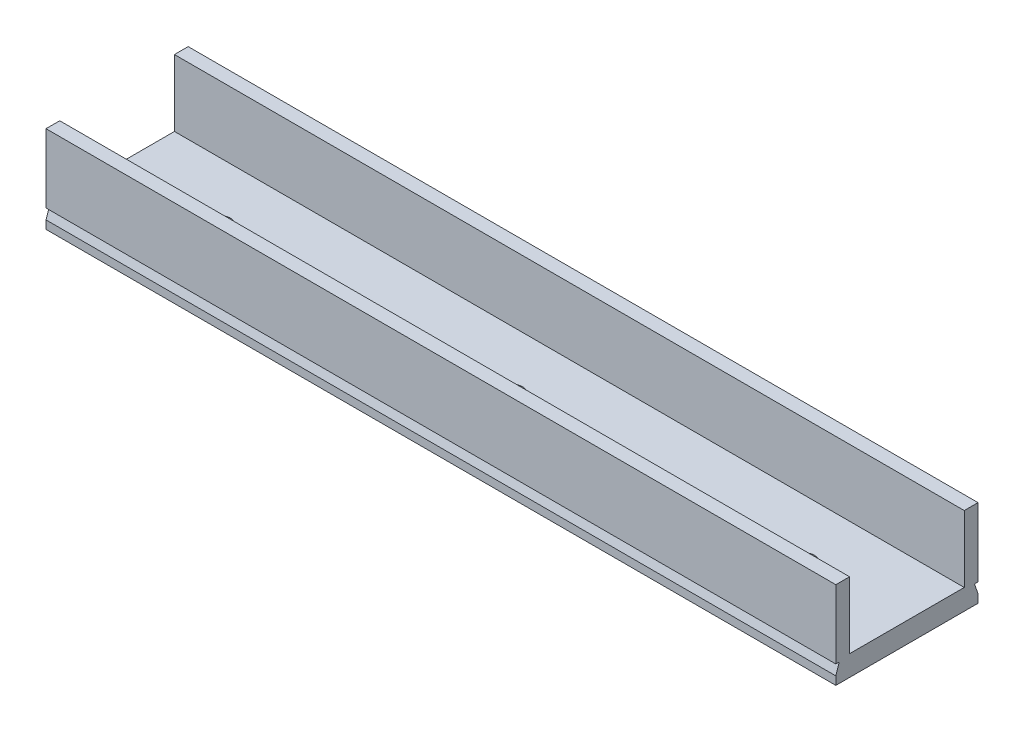
ISO-10303-21;
HEADER;
FILE_DESCRIPTION(('STEP AP214'),'2;1');
FILE_NAME('part.step','',(''),(''),'','','');
FILE_SCHEMA(('AUTOMOTIVE_DESIGN { 1 0 10303 214 1 1 1 1 }'));
ENDSEC;
DATA;
#1=APPLICATION_CONTEXT('core data for automotive mechanical design processes');
#2=APPLICATION_PROTOCOL_DEFINITION('international standard','automotive_design',2000,#1);
#3=PRODUCT_CONTEXT('',#1,'mechanical');
#4=PRODUCT('Part','Part','',(#3));
#5=PRODUCT_RELATED_PRODUCT_CATEGORY('part','',(#4));
#6=PRODUCT_DEFINITION_FORMATION('','',#4);
#7=PRODUCT_DEFINITION_CONTEXT('part definition',#1,'design');
#8=PRODUCT_DEFINITION('design','',#6,#7);
#9=PRODUCT_DEFINITION_SHAPE('','',#8);
#10=(LENGTH_UNIT() NAMED_UNIT(*) SI_UNIT(.MILLI.,.METRE.));
#11=(NAMED_UNIT(*) PLANE_ANGLE_UNIT() SI_UNIT($,.RADIAN.));
#12=(NAMED_UNIT(*) SI_UNIT($,.STERADIAN.) SOLID_ANGLE_UNIT());
#13=UNCERTAINTY_MEASURE_WITH_UNIT(LENGTH_MEASURE(1.E-05),#10,'distance_accuracy_value','');
#14=(GEOMETRIC_REPRESENTATION_CONTEXT(3) GLOBAL_UNCERTAINTY_ASSIGNED_CONTEXT((#13)) GLOBAL_UNIT_ASSIGNED_CONTEXT((#10,
#11,#12)) REPRESENTATION_CONTEXT('',''));
#15=CARTESIAN_POINT('',(0.,0.,0.));
#16=DIRECTION('',(0.,0.,1.));
#17=DIRECTION('',(1.,0.,0.));
#18=AXIS2_PLACEMENT_3D('',#15,#16,#17);
#19=CARTESIAN_POINT('',(0.,3.,-10.35));
#20=DIRECTION('',(0.,0.,1.));
#21=DIRECTION('',(1.,0.,0.));
#22=AXIS2_PLACEMENT_3D('',#19,#20,#21);
#23=PLANE('',#22);
#24=DIRECTION('',(0.,-1.,0.));
#25=VECTOR('',#24,1.);
#26=CARTESIAN_POINT('',(57.5,3.,-10.35));
#27=LINE('',#26,#25);
#28=CARTESIAN_POINT('',(57.5,12.7,-10.35));
#29=VERTEX_POINT('',#28);
#30=CARTESIAN_POINT('',(57.5,2.7,-10.35));
#31=VERTEX_POINT('',#30);
#32=EDGE_CURVE('E256',#29,#31,#27,.T.);
#33=ORIENTED_EDGE('',*,*,#32,.T.);
#34=DIRECTION('',(-1.,0.,0.));
#35=VECTOR('',#34,1.);
#36=CARTESIAN_POINT('',(166.5,2.7,-10.35));
#37=LINE('',#36,#35);
#38=CARTESIAN_POINT('',(-57.5,2.7,-10.35));
#39=VERTEX_POINT('',#38);
#40=EDGE_CURVE('E144',#31,#39,#37,.T.);
#41=ORIENTED_EDGE('',*,*,#40,.T.);
#42=DIRECTION('',(0.,-1.,0.));
#43=VECTOR('',#42,1.);
#44=CARTESIAN_POINT('',(-57.5,3.,-10.35));
#45=LINE('',#44,#43);
#46=CARTESIAN_POINT('',(-57.5,12.7,-10.35));
#47=VERTEX_POINT('',#46);
#48=EDGE_CURVE('E155',#47,#39,#45,.T.);
#49=ORIENTED_EDGE('',*,*,#48,.F.);
#50=DIRECTION('',(-1.,0.,0.));
#51=VECTOR('',#50,1.);
#52=CARTESIAN_POINT('',(-57.5,12.7,-10.35));
#53=LINE('',#52,#51);
#54=EDGE_CURVE('E198',#29,#47,#53,.T.);
#55=ORIENTED_EDGE('',*,*,#54,.F.);
#56=EDGE_LOOP('',(#33,#41,#49,#55));
#57=FACE_BOUND('',#56,.T.);
#58=ADVANCED_FACE('F35',(#57),#23,.F.);
#59=CARTESIAN_POINT('',(0.,3.,10.35));
#60=DIRECTION('',(0.,0.,1.));
#61=DIRECTION('',(1.,0.,0.));
#62=AXIS2_PLACEMENT_3D('',#59,#60,#61);
#63=PLANE('',#62);
#64=DIRECTION('',(1.,0.,0.));
#65=VECTOR('',#64,1.);
#66=CARTESIAN_POINT('',(0.,1.20000000000002,10.35));
#67=LINE('',#66,#65);
#68=CARTESIAN_POINT('',(-57.5,1.2,10.35));
#69=VERTEX_POINT('',#68);
#70=CARTESIAN_POINT('',(57.5,1.2,10.35));
#71=VERTEX_POINT('',#70);
#72=EDGE_CURVE('E11',#69,#71,#67,.T.);
#73=ORIENTED_EDGE('',*,*,#72,.F.);
#74=DIRECTION('',(0.,-1.,0.));
#75=VECTOR('',#74,1.);
#76=CARTESIAN_POINT('',(-57.5,3.,10.35));
#77=LINE('',#76,#75);
#78=CARTESIAN_POINT('',(-57.5,0.,10.35));
#79=VERTEX_POINT('',#78);
#80=EDGE_CURVE('E249',#69,#79,#77,.T.);
#81=ORIENTED_EDGE('',*,*,#80,.T.);
#82=DIRECTION('',(-1.,0.,0.));
#83=VECTOR('',#82,1.);
#84=CARTESIAN_POINT('',(0.,0.,10.35));
#85=LINE('',#84,#83);
#86=CARTESIAN_POINT('',(57.5,0.,10.35));
#87=VERTEX_POINT('',#86);
#88=EDGE_CURVE('E233',#87,#79,#85,.T.);
#89=ORIENTED_EDGE('',*,*,#88,.F.);
#90=DIRECTION('',(0.,-1.,0.));
#91=VECTOR('',#90,1.);
#92=CARTESIAN_POINT('',(57.5,3.,10.35));
#93=LINE('',#92,#91);
#94=EDGE_CURVE('E235',#71,#87,#93,.T.);
#95=ORIENTED_EDGE('',*,*,#94,.F.);
#96=EDGE_LOOP('',(#73,#81,#89,#95));
#97=FACE_BOUND('',#96,.T.);
#98=ADVANCED_FACE('F301',(#97),#63,.T.);
#99=CARTESIAN_POINT('',(0.,3.,0.));
#100=DIRECTION('',(0.,1.,0.));
#101=DIRECTION('',(0.,0.,1.));
#102=AXIS2_PLACEMENT_3D('',#99,#100,#101);
#103=PLANE('',#102);
#104=CARTESIAN_POINT('',(-42.5,3.,0.));
#105=DIRECTION('',(0.,1.,0.));
#106=DIRECTION('',(0.,0.,1.));
#107=AXIS2_PLACEMENT_3D('',#104,#105,#106);
#108=CIRCLE('',#107,1.5);
#109=CARTESIAN_POINT('',(-42.5,3.,1.5));
#110=VERTEX_POINT('',#109);
#111=EDGE_CURVE('E216',#110,#110,#108,.T.);
#112=ORIENTED_EDGE('',*,*,#111,.F.);
#113=EDGE_LOOP('',(#112));
#114=FACE_BOUND('',#113,.T.);
#115=CARTESIAN_POINT('',(0.,3.,0.));
#116=DIRECTION('',(0.,1.,0.));
#117=DIRECTION('',(0.,0.,1.));
#118=AXIS2_PLACEMENT_3D('',#115,#116,#117);
#119=CIRCLE('',#118,1.5);
#120=CARTESIAN_POINT('',(0.,3.,1.5));
#121=VERTEX_POINT('',#120);
#122=EDGE_CURVE('E222',#121,#121,#119,.T.);
#123=ORIENTED_EDGE('',*,*,#122,.F.);
#124=EDGE_LOOP('',(#123));
#125=FACE_BOUND('',#124,.T.);
#126=CARTESIAN_POINT('',(42.5,3.,0.));
#127=DIRECTION('',(0.,1.,0.));
#128=DIRECTION('',(0.,0.,-1.));
#129=AXIS2_PLACEMENT_3D('',#126,#127,#128);
#130=CIRCLE('',#129,1.5);
#131=CARTESIAN_POINT('',(42.5,3.,-1.5));
#132=VERTEX_POINT('',#131);
#133=EDGE_CURVE('E211',#132,#132,#130,.T.);
#134=ORIENTED_EDGE('',*,*,#133,.F.);
#135=EDGE_LOOP('',(#134));
#136=FACE_BOUND('',#135,.T.);
#137=DIRECTION('',(0.,0.,-1.));
#138=VECTOR('',#137,1.);
#139=CARTESIAN_POINT('',(-57.5,3.,0.));
#140=LINE('',#139,#138);
#141=CARTESIAN_POINT('',(-57.5,3.,8.35000000000002));
#142=VERTEX_POINT('',#141);
#143=CARTESIAN_POINT('',(-57.5,3.,-8.35000000000001));
#144=VERTEX_POINT('',#143);
#145=EDGE_CURVE('E232',#142,#144,#140,.T.);
#146=ORIENTED_EDGE('',*,*,#145,.F.);
#147=DIRECTION('',(-1.,0.,0.));
#148=VECTOR('',#147,1.);
#149=CARTESIAN_POINT('',(57.5,3.,8.35));
#150=LINE('',#149,#148);
#151=CARTESIAN_POINT('',(57.5,3.,8.35));
#152=VERTEX_POINT('',#151);
#153=EDGE_CURVE('E173',#152,#142,#150,.T.);
#154=ORIENTED_EDGE('',*,*,#153,.F.);
#155=DIRECTION('',(0.,0.,-1.));
#156=VECTOR('',#155,1.);
#157=CARTESIAN_POINT('',(57.5,3.,0.));
#158=LINE('',#157,#156);
#159=CARTESIAN_POINT('',(57.5,3.,-8.35000000000002));
#160=VERTEX_POINT('',#159);
#161=EDGE_CURVE('E230',#152,#160,#158,.T.);
#162=ORIENTED_EDGE('',*,*,#161,.T.);
#163=DIRECTION('',(1.,0.,0.));
#164=VECTOR('',#163,1.);
#165=CARTESIAN_POINT('',(57.5,3.,-8.35000000000002));
#166=LINE('',#165,#164);
#167=EDGE_CURVE('E191',#144,#160,#166,.T.);
#168=ORIENTED_EDGE('',*,*,#167,.F.);
#169=EDGE_LOOP('',(#146,#154,#162,#168));
#170=FACE_BOUND('',#169,.T.);
#171=ADVANCED_FACE('F278',(#114,#125,#136,#170),#103,.T.);
#172=CARTESIAN_POINT('',(57.5,3.,0.));
#173=DIRECTION('',(-1.,0.,0.));
#174=DIRECTION('',(0.,0.,1.));
#175=AXIS2_PLACEMENT_3D('',#172,#173,#174);
#176=PLANE('',#175);
#177=DIRECTION('',(0.,0.948683298050513,0.316227766016839));
#178=VECTOR('',#177,1.);
#179=CARTESIAN_POINT('',(57.5,5.92500000000001,-8.77499999999999));
#180=LINE('',#179,#178);
#181=CARTESIAN_POINT('',(57.5,1.2,-10.35));
#182=VERTEX_POINT('',#181);
#183=CARTESIAN_POINT('',(57.5,2.7,-9.85));
#184=VERTEX_POINT('',#183);
#185=EDGE_CURVE('E170',#182,#184,#180,.T.);
#186=ORIENTED_EDGE('',*,*,#185,.T.);
#187=DIRECTION('',(0.,0.,-1.));
#188=VECTOR('',#187,1.);
#189=CARTESIAN_POINT('',(57.5,2.7,0.));
#190=LINE('',#189,#188);
#191=EDGE_CURVE('E142',#184,#31,#190,.T.);
#192=ORIENTED_EDGE('',*,*,#191,.T.);
#193=ORIENTED_EDGE('',*,*,#32,.F.);
#194=DIRECTION('',(0.,0.,-1.));
#195=VECTOR('',#194,1.);
#196=CARTESIAN_POINT('',(57.5,12.7,-10.35));
#197=LINE('',#196,#195);
#198=CARTESIAN_POINT('',(57.5,12.7,-8.35000000000002));
#199=VERTEX_POINT('',#198);
#200=EDGE_CURVE('E195',#199,#29,#197,.T.);
#201=ORIENTED_EDGE('',*,*,#200,.F.);
#202=DIRECTION('',(0.,-1.,0.));
#203=VECTOR('',#202,1.);
#204=CARTESIAN_POINT('',(57.5,12.7,-8.35000000000002));
#205=LINE('',#204,#203);
#206=EDGE_CURVE('E208',#199,#160,#205,.T.);
#207=ORIENTED_EDGE('',*,*,#206,.T.);
#208=ORIENTED_EDGE('',*,*,#161,.F.);
#209=DIRECTION('',(0.,-1.,0.));
#210=VECTOR('',#209,1.);
#211=CARTESIAN_POINT('',(57.5,12.7,8.35));
#212=LINE('',#211,#210);
#213=CARTESIAN_POINT('',(57.5,12.7,8.35));
#214=VERTEX_POINT('',#213);
#215=EDGE_CURVE('E189',#214,#152,#212,.T.);
#216=ORIENTED_EDGE('',*,*,#215,.F.);
#217=DIRECTION('',(0.,0.,-1.));
#218=VECTOR('',#217,1.);
#219=CARTESIAN_POINT('',(57.5,12.7,10.35));
#220=LINE('',#219,#218);
#221=CARTESIAN_POINT('',(57.5,12.7,10.35));
#222=VERTEX_POINT('',#221);
#223=EDGE_CURVE('E174',#222,#214,#220,.T.);
#224=ORIENTED_EDGE('',*,*,#223,.F.);
#225=CARTESIAN_POINT('',(57.5,2.7,10.35));
#226=VERTEX_POINT('',#225);
#227=EDGE_CURVE('E246',#222,#226,#93,.T.);
#228=ORIENTED_EDGE('',*,*,#227,.T.);
#229=DIRECTION('',(0.,0.,-1.));
#230=VECTOR('',#229,1.);
#231=CARTESIAN_POINT('',(57.5,2.7,0.));
#232=LINE('',#231,#230);
#233=CARTESIAN_POINT('',(57.5,2.7,9.85));
#234=VERTEX_POINT('',#233);
#235=EDGE_CURVE('E58',#226,#234,#232,.T.);
#236=ORIENTED_EDGE('',*,*,#235,.T.);
#237=DIRECTION('',(0.,-0.948683298050513,0.316227766016839));
#238=VECTOR('',#237,1.);
#239=CARTESIAN_POINT('',(57.5,5.92500000000001,8.77499999999999));
#240=LINE('',#239,#238);
#241=EDGE_CURVE('E167',#234,#71,#240,.T.);
#242=ORIENTED_EDGE('',*,*,#241,.T.);
#243=ORIENTED_EDGE('',*,*,#94,.T.);
#244=DIRECTION('',(0.,0.,-1.));
#245=VECTOR('',#244,1.);
#246=CARTESIAN_POINT('',(57.5,0.,0.));
#247=LINE('',#246,#245);
#248=CARTESIAN_POINT('',(57.5,0.,-10.35));
#249=VERTEX_POINT('',#248);
#250=EDGE_CURVE('E215',#87,#249,#247,.T.);
#251=ORIENTED_EDGE('',*,*,#250,.T.);
#252=EDGE_CURVE('E255',#182,#249,#27,.T.);
#253=ORIENTED_EDGE('',*,*,#252,.F.);
#254=EDGE_LOOP('',(#186,#192,#193,#201,#207,#208,#216,#224,#228,#236,#242,#243,#251,#253));
#255=FACE_BOUND('',#254,.T.);
#256=ADVANCED_FACE('F37',(#255),#176,.F.);
#257=CARTESIAN_POINT('',(-57.5,1.2,-10.35));
#258=VERTEX_POINT('',#257);
#259=CARTESIAN_POINT('',(-57.5,0.,-10.35));
#260=VERTEX_POINT('',#259);
#261=EDGE_CURVE('E253',#258,#260,#45,.T.);
#262=ORIENTED_EDGE('',*,*,#261,.F.);
#263=DIRECTION('',(-1.,0.,0.));
#264=VECTOR('',#263,1.);
#265=CARTESIAN_POINT('',(166.5,1.2,-10.35));
#266=LINE('',#265,#264);
#267=EDGE_CURVE('E50',#182,#258,#266,.T.);
#268=ORIENTED_EDGE('',*,*,#267,.F.);
#269=ORIENTED_EDGE('',*,*,#252,.T.);
#270=DIRECTION('',(-1.,0.,0.));
#271=VECTOR('',#270,1.);
#272=CARTESIAN_POINT('',(0.,0.,-10.35));
#273=LINE('',#272,#271);
#274=EDGE_CURVE('E238',#249,#260,#273,.T.);
#275=ORIENTED_EDGE('',*,*,#274,.T.);
#276=EDGE_LOOP('',(#262,#268,#269,#275));
#277=FACE_BOUND('',#276,.T.);
#278=ADVANCED_FACE('F291',(#277),#23,.F.);
#279=CARTESIAN_POINT('',(-57.5,3.,0.));
#280=DIRECTION('',(-1.,0.,0.));
#281=DIRECTION('',(0.,0.,1.));
#282=AXIS2_PLACEMENT_3D('',#279,#280,#281);
#283=PLANE('',#282);
#284=DIRECTION('',(0.,0.,-1.));
#285=VECTOR('',#284,1.);
#286=CARTESIAN_POINT('',(-57.5,2.7,-10.35));
#287=LINE('',#286,#285);
#288=CARTESIAN_POINT('',(-57.5,2.7,-9.85));
#289=VERTEX_POINT('',#288);
#290=EDGE_CURVE('E139',#289,#39,#287,.T.);
#291=ORIENTED_EDGE('',*,*,#290,.F.);
#292=DIRECTION('',(0.,0.948683298050513,0.316227766016839));
#293=VECTOR('',#292,1.);
#294=CARTESIAN_POINT('',(-57.5,2.7,-9.85));
#295=LINE('',#294,#293);
#296=EDGE_CURVE('E146',#258,#289,#295,.T.);
#297=ORIENTED_EDGE('',*,*,#296,.F.);
#298=ORIENTED_EDGE('',*,*,#261,.T.);
#299=DIRECTION('',(0.,0.,-1.));
#300=VECTOR('',#299,1.);
#301=CARTESIAN_POINT('',(-57.5,0.,0.));
#302=LINE('',#301,#300);
#303=EDGE_CURVE('E241',#79,#260,#302,.T.);
#304=ORIENTED_EDGE('',*,*,#303,.F.);
#305=ORIENTED_EDGE('',*,*,#80,.F.);
#306=DIRECTION('',(0.,-0.948683298050513,0.316227766016839));
#307=VECTOR('',#306,1.);
#308=CARTESIAN_POINT('',(-57.5,2.7,9.85));
#309=LINE('',#308,#307);
#310=CARTESIAN_POINT('',(-57.5,2.7,9.85));
#311=VERTEX_POINT('',#310);
#312=EDGE_CURVE('E163',#311,#69,#309,.T.);
#313=ORIENTED_EDGE('',*,*,#312,.F.);
#314=DIRECTION('',(0.,0.,-1.));
#315=VECTOR('',#314,1.);
#316=CARTESIAN_POINT('',(-57.5,2.7,10.35));
#317=LINE('',#316,#315);
#318=CARTESIAN_POINT('',(-57.5,2.7,10.35));
#319=VERTEX_POINT('',#318);
#320=EDGE_CURVE('E160',#319,#311,#317,.T.);
#321=ORIENTED_EDGE('',*,*,#320,.F.);
#322=CARTESIAN_POINT('',(-57.5,12.7,10.35));
#323=VERTEX_POINT('',#322);
#324=EDGE_CURVE('E250',#323,#319,#77,.T.);
#325=ORIENTED_EDGE('',*,*,#324,.F.);
#326=DIRECTION('',(0.,0.,1.));
#327=VECTOR('',#326,1.);
#328=CARTESIAN_POINT('',(-57.5,12.7,8.35000000000002));
#329=LINE('',#328,#327);
#330=CARTESIAN_POINT('',(-57.5,12.7,8.35000000000002));
#331=VERTEX_POINT('',#330);
#332=EDGE_CURVE('E179',#331,#323,#329,.T.);
#333=ORIENTED_EDGE('',*,*,#332,.F.);
#334=DIRECTION('',(0.,-1.,0.));
#335=VECTOR('',#334,1.);
#336=CARTESIAN_POINT('',(-57.5,12.7,8.35000000000002));
#337=LINE('',#336,#335);
#338=EDGE_CURVE('E185',#331,#142,#337,.T.);
#339=ORIENTED_EDGE('',*,*,#338,.T.);
#340=ORIENTED_EDGE('',*,*,#145,.T.);
#341=DIRECTION('',(0.,-1.,0.));
#342=VECTOR('',#341,1.);
#343=CARTESIAN_POINT('',(-57.5,12.7,-8.35));
#344=LINE('',#343,#342);
#345=CARTESIAN_POINT('',(-57.5,12.7,-8.35));
#346=VERTEX_POINT('',#345);
#347=EDGE_CURVE('E203',#346,#144,#344,.T.);
#348=ORIENTED_EDGE('',*,*,#347,.F.);
#349=DIRECTION('',(0.,0.,1.));
#350=VECTOR('',#349,1.);
#351=CARTESIAN_POINT('',(-57.5,12.7,-8.35));
#352=LINE('',#351,#350);
#353=EDGE_CURVE('E201',#47,#346,#352,.T.);
#354=ORIENTED_EDGE('',*,*,#353,.F.);
#355=ORIENTED_EDGE('',*,*,#48,.T.);
#356=EDGE_LOOP('',(#291,#297,#298,#304,#305,#313,#321,#325,#333,#339,#340,#348,#354,#355));
#357=FACE_BOUND('',#356,.T.);
#358=ADVANCED_FACE('F153',(#357),#283,.T.);
#359=DIRECTION('',(-1.,0.,0.));
#360=VECTOR('',#359,1.);
#361=CARTESIAN_POINT('',(0.,2.7,10.35));
#362=LINE('',#361,#360);
#363=EDGE_CURVE('E43',#226,#319,#362,.T.);
#364=ORIENTED_EDGE('',*,*,#363,.F.);
#365=ORIENTED_EDGE('',*,*,#227,.F.);
#366=DIRECTION('',(1.,0.,0.));
#367=VECTOR('',#366,1.);
#368=CARTESIAN_POINT('',(-57.5,12.7,10.35));
#369=LINE('',#368,#367);
#370=EDGE_CURVE('E182',#323,#222,#369,.T.);
#371=ORIENTED_EDGE('',*,*,#370,.F.);
#372=ORIENTED_EDGE('',*,*,#324,.T.);
#373=EDGE_LOOP('',(#364,#365,#371,#372));
#374=FACE_BOUND('',#373,.T.);
#375=ADVANCED_FACE('F265',(#374),#63,.T.);
#376=CARTESIAN_POINT('',(0.,0.,0.));
#377=DIRECTION('',(0.,1.,0.));
#378=DIRECTION('',(0.,0.,1.));
#379=AXIS2_PLACEMENT_3D('',#376,#377,#378);
#380=PLANE('',#379);
#381=CARTESIAN_POINT('',(-42.5,0.,0.));
#382=DIRECTION('',(0.,1.,0.));
#383=DIRECTION('',(0.,0.,1.));
#384=AXIS2_PLACEMENT_3D('',#381,#382,#383);
#385=CIRCLE('',#384,1.5);
#386=CARTESIAN_POINT('',(-42.5,0.,1.5));
#387=VERTEX_POINT('',#386);
#388=EDGE_CURVE('E212',#387,#387,#385,.T.);
#389=ORIENTED_EDGE('',*,*,#388,.T.);
#390=EDGE_LOOP('',(#389));
#391=FACE_BOUND('',#390,.T.);
#392=CARTESIAN_POINT('',(0.,0.,0.));
#393=DIRECTION('',(0.,1.,0.));
#394=DIRECTION('',(0.,0.,1.));
#395=AXIS2_PLACEMENT_3D('',#392,#393,#394);
#396=CIRCLE('',#395,1.5);
#397=CARTESIAN_POINT('',(0.,0.,1.5));
#398=VERTEX_POINT('',#397);
#399=EDGE_CURVE('E219',#398,#398,#396,.T.);
#400=ORIENTED_EDGE('',*,*,#399,.T.);
#401=EDGE_LOOP('',(#400));
#402=FACE_BOUND('',#401,.T.);
#403=CARTESIAN_POINT('',(42.5,0.,0.));
#404=DIRECTION('',(0.,1.,0.));
#405=DIRECTION('',(0.,0.,-1.));
#406=AXIS2_PLACEMENT_3D('',#403,#404,#405);
#407=CIRCLE('',#406,1.5);
#408=CARTESIAN_POINT('',(42.5,0.,-1.5));
#409=VERTEX_POINT('',#408);
#410=EDGE_CURVE('E225',#409,#409,#407,.T.);
#411=ORIENTED_EDGE('',*,*,#410,.T.);
#412=EDGE_LOOP('',(#411));
#413=FACE_BOUND('',#412,.T.);
#414=ORIENTED_EDGE('',*,*,#250,.F.);
#415=ORIENTED_EDGE('',*,*,#88,.T.);
#416=ORIENTED_EDGE('',*,*,#303,.T.);
#417=ORIENTED_EDGE('',*,*,#274,.F.);
#418=EDGE_LOOP('',(#414,#415,#416,#417));
#419=FACE_BOUND('',#418,.T.);
#420=ADVANCED_FACE('F297',(#391,#402,#413,#419),#380,.F.);
#421=CARTESIAN_POINT('',(42.5,0.,0.));
#422=DIRECTION('',(0.,1.,0.));
#423=DIRECTION('',(0.,0.,1.));
#424=AXIS2_PLACEMENT_3D('',#421,#422,#423);
#425=CYLINDRICAL_SURFACE('',#424,1.5);
#426=ORIENTED_EDGE('',*,*,#410,.F.);
#427=EDGE_LOOP('',(#426));
#428=FACE_BOUND('',#427,.T.);
#429=ORIENTED_EDGE('',*,*,#133,.T.);
#430=EDGE_LOOP('',(#429));
#431=FACE_BOUND('',#430,.T.);
#432=ADVANCED_FACE('F335',(#428,#431),#425,.F.);
#433=CARTESIAN_POINT('',(0.,0.,0.));
#434=DIRECTION('',(0.,1.,0.));
#435=DIRECTION('',(0.,0.,1.));
#436=AXIS2_PLACEMENT_3D('',#433,#434,#435);
#437=CYLINDRICAL_SURFACE('',#436,1.5);
#438=ORIENTED_EDGE('',*,*,#399,.F.);
#439=EDGE_LOOP('',(#438));
#440=FACE_BOUND('',#439,.T.);
#441=ORIENTED_EDGE('',*,*,#122,.T.);
#442=EDGE_LOOP('',(#441));
#443=FACE_BOUND('',#442,.T.);
#444=ADVANCED_FACE('F354',(#440,#443),#437,.F.);
#445=CARTESIAN_POINT('',(-42.5,0.,0.));
#446=DIRECTION('',(0.,1.,0.));
#447=DIRECTION('',(0.,0.,1.));
#448=AXIS2_PLACEMENT_3D('',#445,#446,#447);
#449=CYLINDRICAL_SURFACE('',#448,1.5);
#450=ORIENTED_EDGE('',*,*,#388,.F.);
#451=EDGE_LOOP('',(#450));
#452=FACE_BOUND('',#451,.T.);
#453=ORIENTED_EDGE('',*,*,#111,.T.);
#454=EDGE_LOOP('',(#453));
#455=FACE_BOUND('',#454,.T.);
#456=ADVANCED_FACE('F361',(#452,#455),#449,.F.);
#457=CARTESIAN_POINT('',(57.5,12.7,-8.35000000000002));
#458=DIRECTION('',(0.,0.,-1.));
#459=DIRECTION('',(-1.,0.,0.));
#460=AXIS2_PLACEMENT_3D('',#457,#458,#459);
#461=PLANE('',#460);
#462=ORIENTED_EDGE('',*,*,#167,.T.);
#463=ORIENTED_EDGE('',*,*,#206,.F.);
#464=DIRECTION('',(1.,0.,0.));
#465=VECTOR('',#464,1.);
#466=CARTESIAN_POINT('',(57.5,12.7,-8.35000000000002));
#467=LINE('',#466,#465);
#468=EDGE_CURVE('E192',#346,#199,#467,.T.);
#469=ORIENTED_EDGE('',*,*,#468,.F.);
#470=ORIENTED_EDGE('',*,*,#347,.T.);
#471=EDGE_LOOP('',(#462,#463,#469,#470));
#472=FACE_BOUND('',#471,.T.);
#473=ADVANCED_FACE('F284',(#472),#461,.F.);
#474=CARTESIAN_POINT('',(0.,12.7,0.));
#475=DIRECTION('',(0.,-1.,0.));
#476=DIRECTION('',(0.,0.,-1.));
#477=AXIS2_PLACEMENT_3D('',#474,#475,#476);
#478=PLANE('',#477);
#479=ORIENTED_EDGE('',*,*,#468,.T.);
#480=ORIENTED_EDGE('',*,*,#200,.T.);
#481=ORIENTED_EDGE('',*,*,#54,.T.);
#482=ORIENTED_EDGE('',*,*,#353,.T.);
#483=EDGE_LOOP('',(#479,#480,#481,#482));
#484=FACE_BOUND('',#483,.T.);
#485=ADVANCED_FACE('F286',(#484),#478,.F.);
#486=CARTESIAN_POINT('',(57.5,12.7,8.35));
#487=DIRECTION('',(0.,0.,1.));
#488=DIRECTION('',(1.,0.,0.));
#489=AXIS2_PLACEMENT_3D('',#486,#487,#488);
#490=PLANE('',#489);
#491=ORIENTED_EDGE('',*,*,#153,.T.);
#492=ORIENTED_EDGE('',*,*,#338,.F.);
#493=DIRECTION('',(-1.,0.,0.));
#494=VECTOR('',#493,1.);
#495=CARTESIAN_POINT('',(57.5,12.7,8.35));
#496=LINE('',#495,#494);
#497=EDGE_CURVE('E177',#214,#331,#496,.T.);
#498=ORIENTED_EDGE('',*,*,#497,.F.);
#499=ORIENTED_EDGE('',*,*,#215,.T.);
#500=EDGE_LOOP('',(#491,#492,#498,#499));
#501=FACE_BOUND('',#500,.T.);
#502=ADVANCED_FACE('F274',(#501),#490,.F.);
#503=CARTESIAN_POINT('',(0.,12.7,0.));
#504=DIRECTION('',(0.,1.,0.));
#505=DIRECTION('',(0.,0.,1.));
#506=AXIS2_PLACEMENT_3D('',#503,#504,#505);
#507=PLANE('',#506);
#508=ORIENTED_EDGE('',*,*,#223,.T.);
#509=ORIENTED_EDGE('',*,*,#497,.T.);
#510=ORIENTED_EDGE('',*,*,#332,.T.);
#511=ORIENTED_EDGE('',*,*,#370,.T.);
#512=EDGE_LOOP('',(#508,#509,#510,#511));
#513=FACE_BOUND('',#512,.T.);
#514=ADVANCED_FACE('F268',(#513),#507,.T.);
#515=CARTESIAN_POINT('',(166.5,2.7,9.85));
#516=DIRECTION('',(0.,-0.316227766016839,-0.948683298050513));
#517=DIRECTION('',(0.,0.948683298050513,-0.316227766016839));
#518=AXIS2_PLACEMENT_3D('',#515,#516,#517);
#519=PLANE('',#518);
#520=DIRECTION('',(-1.,0.,0.));
#521=VECTOR('',#520,1.);
#522=CARTESIAN_POINT('',(166.5,2.7,9.85));
#523=LINE('',#522,#521);
#524=EDGE_CURVE('E150',#234,#311,#523,.T.);
#525=ORIENTED_EDGE('',*,*,#524,.T.);
#526=ORIENTED_EDGE('',*,*,#312,.T.);
#527=ORIENTED_EDGE('',*,*,#72,.T.);
#528=ORIENTED_EDGE('',*,*,#241,.F.);
#529=EDGE_LOOP('',(#525,#526,#527,#528));
#530=FACE_BOUND('',#529,.T.);
#531=ADVANCED_FACE('F303',(#530),#519,.F.);
#532=CARTESIAN_POINT('',(166.5,2.7,10.35));
#533=DIRECTION('',(0.,1.,0.));
#534=DIRECTION('',(0.,0.,1.));
#535=AXIS2_PLACEMENT_3D('',#532,#533,#534);
#536=PLANE('',#535);
#537=ORIENTED_EDGE('',*,*,#363,.T.);
#538=ORIENTED_EDGE('',*,*,#320,.T.);
#539=ORIENTED_EDGE('',*,*,#524,.F.);
#540=ORIENTED_EDGE('',*,*,#235,.F.);
#541=EDGE_LOOP('',(#537,#538,#539,#540));
#542=FACE_BOUND('',#541,.T.);
#543=ADVANCED_FACE('F259',(#542),#536,.F.);
#544=CARTESIAN_POINT('',(166.5,2.7,-10.35));
#545=DIRECTION('',(0.,1.,0.));
#546=DIRECTION('',(0.,0.,1.));
#547=AXIS2_PLACEMENT_3D('',#544,#545,#546);
#548=PLANE('',#547);
#549=DIRECTION('',(-1.,0.,0.));
#550=VECTOR('',#549,1.);
#551=CARTESIAN_POINT('',(166.5,2.7,-9.85));
#552=LINE('',#551,#550);
#553=EDGE_CURVE('E136',#184,#289,#552,.T.);
#554=ORIENTED_EDGE('',*,*,#553,.T.);
#555=ORIENTED_EDGE('',*,*,#290,.T.);
#556=ORIENTED_EDGE('',*,*,#40,.F.);
#557=ORIENTED_EDGE('',*,*,#191,.F.);
#558=EDGE_LOOP('',(#554,#555,#556,#557));
#559=FACE_BOUND('',#558,.T.);
#560=ADVANCED_FACE('F137',(#559),#548,.F.);
#561=CARTESIAN_POINT('',(166.5,2.7,-9.85));
#562=DIRECTION('',(0.,-0.316227766016839,0.948683298050513));
#563=DIRECTION('',(0.,-0.948683298050513,-0.316227766016839));
#564=AXIS2_PLACEMENT_3D('',#561,#562,#563);
#565=PLANE('',#564);
#566=ORIENTED_EDGE('',*,*,#267,.T.);
#567=ORIENTED_EDGE('',*,*,#296,.T.);
#568=ORIENTED_EDGE('',*,*,#553,.F.);
#569=ORIENTED_EDGE('',*,*,#185,.F.);
#570=EDGE_LOOP('',(#566,#567,#568,#569));
#571=FACE_BOUND('',#570,.T.);
#572=ADVANCED_FACE('F147',(#571),#565,.F.);
#573=CLOSED_SHELL('',(#58,#98,#171,#256,#278,#358,#375,#420,#432,#444,#456,#473,#485,#502,#514,
#531,#543,#560,#572));
#574=MANIFOLD_SOLID_BREP('B2',#573);
#575=ADVANCED_BREP_SHAPE_REPRESENTATION('',(#18,#574),#14);
#576=SHAPE_DEFINITION_REPRESENTATION(#9,#575);
ENDSEC;
END-ISO-10303-21;
